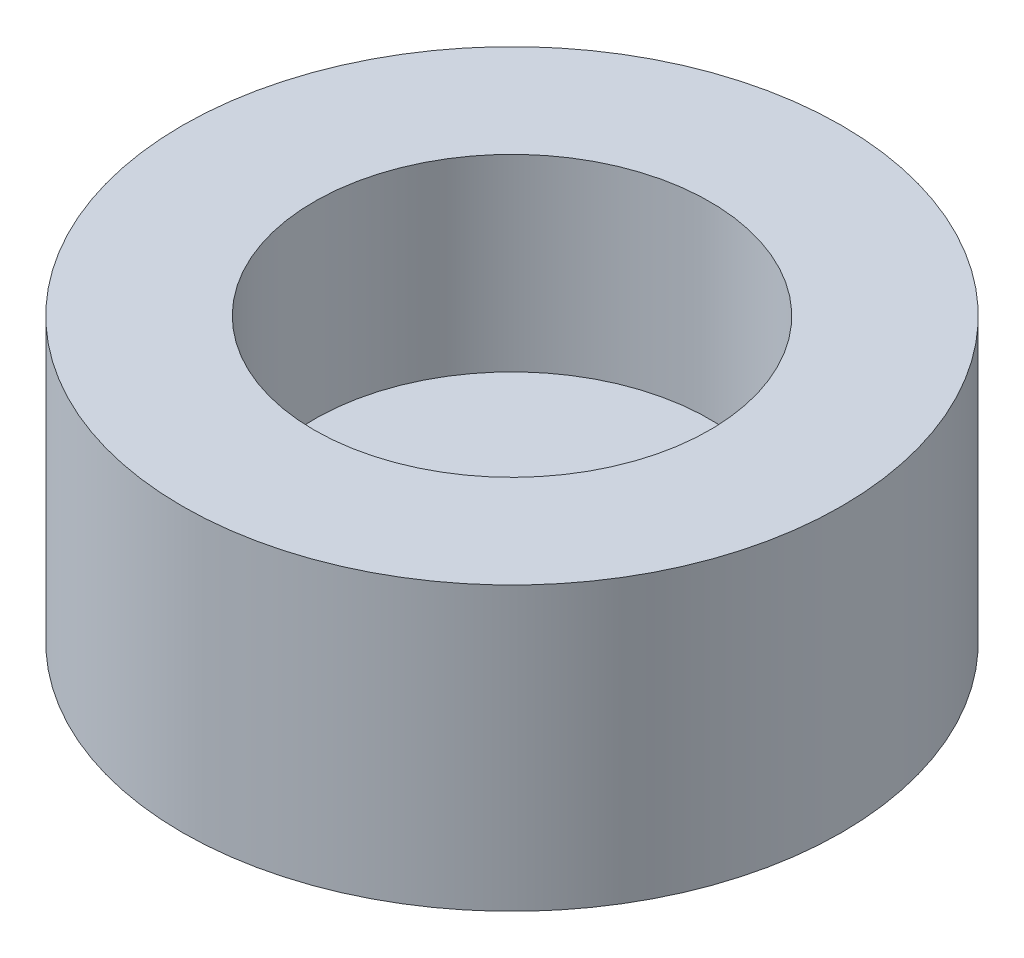
ISO-10303-21;
HEADER;
FILE_DESCRIPTION(('STEP AP214'),'2;1');
FILE_NAME('part.step','',(''),(''),'','','');
FILE_SCHEMA(('AUTOMOTIVE_DESIGN { 1 0 10303 214 1 1 1 1 }'));
ENDSEC;
DATA;
#1=APPLICATION_CONTEXT('core data for automotive mechanical design processes');
#2=APPLICATION_PROTOCOL_DEFINITION('international standard','automotive_design',2000,#1);
#3=PRODUCT_CONTEXT('',#1,'mechanical');
#4=PRODUCT('Part','Part','',(#3));
#5=PRODUCT_RELATED_PRODUCT_CATEGORY('part','',(#4));
#6=PRODUCT_DEFINITION_FORMATION('','',#4);
#7=PRODUCT_DEFINITION_CONTEXT('part definition',#1,'design');
#8=PRODUCT_DEFINITION('design','',#6,#7);
#9=PRODUCT_DEFINITION_SHAPE('','',#8);
#10=(LENGTH_UNIT() NAMED_UNIT(*) SI_UNIT(.MILLI.,.METRE.));
#11=(NAMED_UNIT(*) PLANE_ANGLE_UNIT() SI_UNIT($,.RADIAN.));
#12=(NAMED_UNIT(*) SI_UNIT($,.STERADIAN.) SOLID_ANGLE_UNIT());
#13=UNCERTAINTY_MEASURE_WITH_UNIT(LENGTH_MEASURE(1.E-05),#10,'distance_accuracy_value','');
#14=(GEOMETRIC_REPRESENTATION_CONTEXT(3) GLOBAL_UNCERTAINTY_ASSIGNED_CONTEXT((#13)) GLOBAL_UNIT_ASSIGNED_CONTEXT((#10,
#11,#12)) REPRESENTATION_CONTEXT('',''));
#15=CARTESIAN_POINT('',(0.,0.,0.));
#16=DIRECTION('',(0.,0.,1.));
#17=DIRECTION('',(1.,0.,0.));
#18=AXIS2_PLACEMENT_3D('',#15,#16,#17);
#19=CARTESIAN_POINT('',(0.,3.,0.));
#20=DIRECTION('',(0.,-1.,0.));
#21=DIRECTION('',(0.,0.,-1.));
#22=AXIS2_PLACEMENT_3D('',#19,#20,#21);
#23=CYLINDRICAL_SURFACE('',#22,3.5);
#24=CARTESIAN_POINT('',(0.,3.,0.));
#25=DIRECTION('',(0.,1.,0.));
#26=DIRECTION('',(0.,0.,1.));
#27=AXIS2_PLACEMENT_3D('',#24,#25,#26);
#28=CIRCLE('',#27,3.5);
#29=CARTESIAN_POINT('',(0.,3.,3.5));
#30=VERTEX_POINT('',#29);
#31=EDGE_CURVE('E10',#30,#30,#28,.T.);
#32=ORIENTED_EDGE('',*,*,#31,.F.);
#33=EDGE_LOOP('',(#32));
#34=FACE_BOUND('',#33,.T.);
#35=CARTESIAN_POINT('',(0.,0.,0.));
#36=DIRECTION('',(0.,1.,0.));
#37=DIRECTION('',(0.,0.,1.));
#38=AXIS2_PLACEMENT_3D('',#35,#36,#37);
#39=CIRCLE('',#38,3.5);
#40=CARTESIAN_POINT('',(0.,0.,3.5));
#41=VERTEX_POINT('',#40);
#42=EDGE_CURVE('E38',#41,#41,#39,.T.);
#43=ORIENTED_EDGE('',*,*,#42,.T.);
#44=EDGE_LOOP('',(#43));
#45=FACE_BOUND('',#44,.T.);
#46=ADVANCED_FACE('F35',(#34,#45),#23,.T.);
#47=CARTESIAN_POINT('',(0.,3.,0.));
#48=DIRECTION('',(0.,1.,0.));
#49=DIRECTION('',(0.,0.,1.));
#50=AXIS2_PLACEMENT_3D('',#47,#48,#49);
#51=PLANE('',#50);
#52=CARTESIAN_POINT('',(0.,3.,0.));
#53=DIRECTION('',(0.,1.,0.));
#54=DIRECTION('',(0.,0.,1.));
#55=AXIS2_PLACEMENT_3D('',#52,#53,#54);
#56=CIRCLE('',#55,2.1);
#57=CARTESIAN_POINT('',(0.,3.,2.1));
#58=VERTEX_POINT('',#57);
#59=EDGE_CURVE('E47',#58,#58,#56,.T.);
#60=ORIENTED_EDGE('',*,*,#59,.F.);
#61=EDGE_LOOP('',(#60));
#62=FACE_BOUND('',#61,.T.);
#63=ORIENTED_EDGE('',*,*,#31,.T.);
#64=EDGE_LOOP('',(#63));
#65=FACE_BOUND('',#64,.T.);
#66=ADVANCED_FACE('F62',(#62,#65),#51,.T.);
#67=CARTESIAN_POINT('',(0.,0.,0.));
#68=DIRECTION('',(0.,1.,0.));
#69=DIRECTION('',(0.,0.,1.));
#70=AXIS2_PLACEMENT_3D('',#67,#68,#69);
#71=PLANE('',#70);
#72=ORIENTED_EDGE('',*,*,#42,.F.);
#73=EDGE_LOOP('',(#72));
#74=FACE_BOUND('',#73,.T.);
#75=ADVANCED_FACE('F58',(#74),#71,.F.);
#76=CARTESIAN_POINT('',(0.,1.,0.));
#77=DIRECTION('',(0.,1.,0.));
#78=DIRECTION('',(0.,0.,1.));
#79=AXIS2_PLACEMENT_3D('',#76,#77,#78);
#80=CYLINDRICAL_SURFACE('',#79,2.1);
#81=CARTESIAN_POINT('',(0.,1.,0.));
#82=DIRECTION('',(0.,1.,0.));
#83=DIRECTION('',(0.,0.,1.));
#84=AXIS2_PLACEMENT_3D('',#81,#82,#83);
#85=CIRCLE('',#84,2.1);
#86=CARTESIAN_POINT('',(0.,1.,2.1));
#87=VERTEX_POINT('',#86);
#88=EDGE_CURVE('E45',#87,#87,#85,.T.);
#89=ORIENTED_EDGE('',*,*,#88,.F.);
#90=EDGE_LOOP('',(#89));
#91=FACE_BOUND('',#90,.T.);
#92=ORIENTED_EDGE('',*,*,#59,.T.);
#93=EDGE_LOOP('',(#92));
#94=FACE_BOUND('',#93,.T.);
#95=ADVANCED_FACE('F55',(#91,#94),#80,.F.);
#96=CARTESIAN_POINT('',(0.,1.,0.));
#97=DIRECTION('',(0.,1.,0.));
#98=DIRECTION('',(0.,0.,1.));
#99=AXIS2_PLACEMENT_3D('',#96,#97,#98);
#100=PLANE('',#99);
#101=ORIENTED_EDGE('',*,*,#88,.T.);
#102=EDGE_LOOP('',(#101));
#103=FACE_BOUND('',#102,.T.);
#104=ADVANCED_FACE('F53',(#103),#100,.T.);
#105=CLOSED_SHELL('',(#46,#66,#75,#95,#104));
#106=MANIFOLD_SOLID_BREP('B2',#105);
#107=ADVANCED_BREP_SHAPE_REPRESENTATION('',(#18,#106),#14);
#108=SHAPE_DEFINITION_REPRESENTATION(#9,#107);
ENDSEC;
END-ISO-10303-21;
